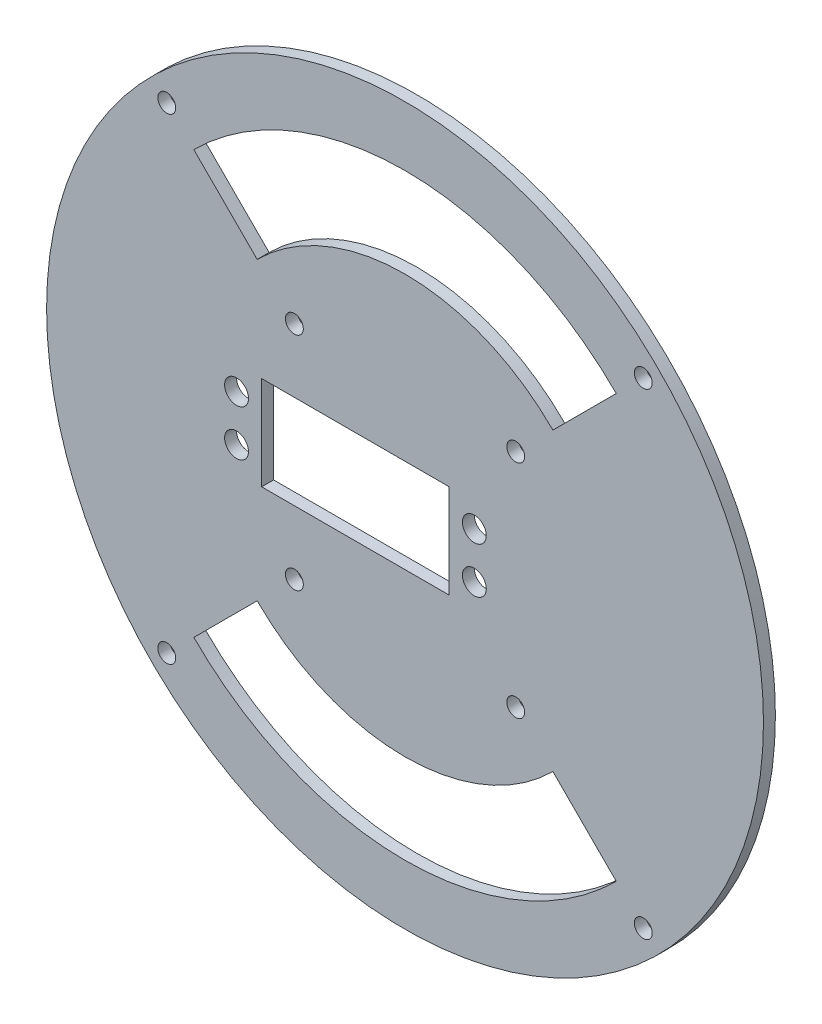
ISO-10303-21;
HEADER;
FILE_DESCRIPTION(('STEP AP214'),'2;1');
FILE_NAME('part.step','',(''),(''),'','','');
FILE_SCHEMA(('AUTOMOTIVE_DESIGN { 1 0 10303 214 1 1 1 1 }'));
ENDSEC;
DATA;
#1=APPLICATION_CONTEXT('core data for automotive mechanical design processes');
#2=APPLICATION_PROTOCOL_DEFINITION('international standard','automotive_design',2000,#1);
#3=PRODUCT_CONTEXT('',#1,'mechanical');
#4=PRODUCT('Part','Part','',(#3));
#5=PRODUCT_RELATED_PRODUCT_CATEGORY('part','',(#4));
#6=PRODUCT_DEFINITION_FORMATION('','',#4);
#7=PRODUCT_DEFINITION_CONTEXT('part definition',#1,'design');
#8=PRODUCT_DEFINITION('design','',#6,#7);
#9=PRODUCT_DEFINITION_SHAPE('','',#8);
#10=(LENGTH_UNIT() NAMED_UNIT(*) SI_UNIT(.MILLI.,.METRE.));
#11=(NAMED_UNIT(*) PLANE_ANGLE_UNIT() SI_UNIT($,.RADIAN.));
#12=(NAMED_UNIT(*) SI_UNIT($,.STERADIAN.) SOLID_ANGLE_UNIT());
#13=UNCERTAINTY_MEASURE_WITH_UNIT(LENGTH_MEASURE(1.E-05),#10,'distance_accuracy_value','');
#14=(GEOMETRIC_REPRESENTATION_CONTEXT(3) GLOBAL_UNCERTAINTY_ASSIGNED_CONTEXT((#13)) GLOBAL_UNIT_ASSIGNED_CONTEXT((#10,
#11,#12)) REPRESENTATION_CONTEXT('',''));
#15=CARTESIAN_POINT('',(0.,0.,0.));
#16=DIRECTION('',(0.,0.,1.));
#17=DIRECTION('',(1.,0.,0.));
#18=AXIS2_PLACEMENT_3D('',#15,#16,#17);
#19=CARTESIAN_POINT('',(0.,0.,2.54));
#20=DIRECTION('',(0.,0.,1.));
#21=DIRECTION('',(1.,0.,0.));
#22=AXIS2_PLACEMENT_3D('',#19,#20,#21);
#23=PLANE('',#22);
#24=CARTESIAN_POINT('',(-50.6486445228304,-50.6486445228297,2.54));
#25=DIRECTION('',(0.,0.,1.));
#26=DIRECTION('',(1.,0.,0.));
#27=AXIS2_PLACEMENT_3D('',#24,#25,#26);
#28=CIRCLE('',#27,1.905);
#29=CARTESIAN_POINT('',(-48.7436445228304,-50.6486445228297,2.54));
#30=VERTEX_POINT('',#29);
#31=EDGE_CURVE('E366',#30,#30,#28,.T.);
#32=ORIENTED_EDGE('',*,*,#31,.F.);
#33=EDGE_LOOP('',(#32));
#34=FACE_BOUND('',#33,.T.);
#35=CARTESIAN_POINT('',(-23.5282710372009,23.5282710372014,2.54));
#36=DIRECTION('',(0.,0.,1.));
#37=DIRECTION('',(1.,0.,0.));
#38=AXIS2_PLACEMENT_3D('',#35,#36,#37);
#39=CIRCLE('',#38,1.905);
#40=CARTESIAN_POINT('',(-21.6232710372009,23.5282710372014,2.54));
#41=VERTEX_POINT('',#40);
#42=EDGE_CURVE('E378',#41,#41,#39,.T.);
#43=ORIENTED_EDGE('',*,*,#42,.F.);
#44=EDGE_LOOP('',(#43));
#45=FACE_BOUND('',#44,.T.);
#46=CARTESIAN_POINT('',(23.5282710372011,-23.5282710372013,2.54));
#47=DIRECTION('',(0.,0.,1.));
#48=DIRECTION('',(1.,0.,0.));
#49=AXIS2_PLACEMENT_3D('',#46,#47,#48);
#50=CIRCLE('',#49,1.905);
#51=CARTESIAN_POINT('',(25.4332710372011,-23.5282710372013,2.54));
#52=VERTEX_POINT('',#51);
#53=EDGE_CURVE('E390',#52,#52,#50,.T.);
#54=ORIENTED_EDGE('',*,*,#53,.F.);
#55=EDGE_LOOP('',(#54));
#56=FACE_BOUND('',#55,.T.);
#57=DIRECTION('',(0.707106781186551,0.707106781186544,0.));
#58=VECTOR('',#57,1.);
#59=CARTESIAN_POINT('',(44.901280605346,44.9012806053455,2.54));
#60=LINE('',#59,#58);
#61=CARTESIAN_POINT('',(31.4308964237422,31.4308964237419,2.54));
#62=VERTEX_POINT('',#61);
#63=CARTESIAN_POINT('',(44.901280605346,44.9012806053455,2.54));
#64=VERTEX_POINT('',#63);
#65=EDGE_CURVE('E144',#62,#64,#60,.T.);
#66=ORIENTED_EDGE('',*,*,#65,.F.);
#67=CARTESIAN_POINT('',(0.,0.,2.54));
#68=DIRECTION('',(0.,0.,-1.));
#69=DIRECTION('',(1.,0.,0.));
#70=AXIS2_PLACEMENT_3D('',#67,#68,#69);
#71=CIRCLE('',#70,44.45);
#72=CARTESIAN_POINT('',(-31.4308964237318,31.4308964237523,2.54));
#73=VERTEX_POINT('',#72);
#74=EDGE_CURVE('E135',#73,#62,#71,.T.);
#75=ORIENTED_EDGE('',*,*,#74,.F.);
#76=DIRECTION('',(0.707106781186544,-0.707106781186551,0.));
#77=VECTOR('',#76,1.);
#78=CARTESIAN_POINT('',(-31.4308964237318,31.4308964237523,2.54));
#79=LINE('',#78,#77);
#80=CARTESIAN_POINT('',(-44.9012806053355,44.9012806053561,2.54));
#81=VERTEX_POINT('',#80);
#82=EDGE_CURVE('E162',#81,#73,#79,.T.);
#83=ORIENTED_EDGE('',*,*,#82,.F.);
#84=CARTESIAN_POINT('',(0.,0.,2.54));
#85=DIRECTION('',(0.,0.,1.));
#86=DIRECTION('',(-1.,0.,0.));
#87=AXIS2_PLACEMENT_3D('',#84,#85,#86);
#88=CIRCLE('',#87,63.5);
#89=EDGE_CURVE('E158',#64,#81,#88,.T.);
#90=ORIENTED_EDGE('',*,*,#89,.F.);
#91=EDGE_LOOP('',(#66,#75,#83,#90));
#92=FACE_BOUND('',#91,.T.);
#93=CARTESIAN_POINT('',(23.5282710372012,23.5282710372012,2.54));
#94=DIRECTION('',(0.,0.,1.));
#95=DIRECTION('',(1.,0.,0.));
#96=AXIS2_PLACEMENT_3D('',#93,#94,#95);
#97=CIRCLE('',#96,1.905);
#98=CARTESIAN_POINT('',(25.4332710372012,23.5282710372012,2.54));
#99=VERTEX_POINT('',#98);
#100=EDGE_CURVE('E186',#99,#99,#97,.T.);
#101=ORIENTED_EDGE('',*,*,#100,.F.);
#102=EDGE_LOOP('',(#101));
#103=FACE_BOUND('',#102,.T.);
#104=CARTESIAN_POINT('',(-35.814,4.8895,2.54));
#105=DIRECTION('',(0.,0.,1.));
#106=DIRECTION('',(1.,0.,0.));
#107=AXIS2_PLACEMENT_3D('',#104,#105,#106);
#108=CIRCLE('',#107,2.54);
#109=CARTESIAN_POINT('',(-33.274,4.8895,2.54));
#110=VERTEX_POINT('',#109);
#111=EDGE_CURVE('E245',#110,#110,#108,.T.);
#112=ORIENTED_EDGE('',*,*,#111,.F.);
#113=EDGE_LOOP('',(#112));
#114=FACE_BOUND('',#113,.T.);
#115=CARTESIAN_POINT('',(14.732,-4.8895,2.54));
#116=DIRECTION('',(0.,0.,1.));
#117=DIRECTION('',(1.,0.,0.));
#118=AXIS2_PLACEMENT_3D('',#115,#116,#117);
#119=CIRCLE('',#118,2.54);
#120=CARTESIAN_POINT('',(17.272,-4.8895,2.54));
#121=VERTEX_POINT('',#120);
#122=EDGE_CURVE('E261',#121,#121,#119,.T.);
#123=ORIENTED_EDGE('',*,*,#122,.F.);
#124=EDGE_LOOP('',(#123));
#125=FACE_BOUND('',#124,.T.);
#126=CARTESIAN_POINT('',(0.,0.,2.54));
#127=DIRECTION('',(0.,0.,1.));
#128=DIRECTION('',(1.,0.,0.));
#129=AXIS2_PLACEMENT_3D('',#126,#127,#128);
#130=CIRCLE('',#129,76.2);
#131=CARTESIAN_POINT('',(76.2,0.,2.54));
#132=VERTEX_POINT('',#131);
#133=EDGE_CURVE('E11',#132,#132,#130,.T.);
#134=ORIENTED_EDGE('',*,*,#133,.T.);
#135=EDGE_LOOP('',(#134));
#136=FACE_BOUND('',#135,.T.);
#137=DIRECTION('',(1.,0.,0.));
#138=VECTOR('',#137,1.);
#139=CARTESIAN_POINT('',(-30.48,-9.9695,2.54));
#140=LINE('',#139,#138);
#141=CARTESIAN_POINT('',(-30.48,-9.9695,2.54));
#142=VERTEX_POINT('',#141);
#143=CARTESIAN_POINT('',(9.398,-9.9695,2.54));
#144=VERTEX_POINT('',#143);
#145=EDGE_CURVE('E272',#142,#144,#140,.T.);
#146=ORIENTED_EDGE('',*,*,#145,.F.);
#147=DIRECTION('',(0.,-1.,0.));
#148=VECTOR('',#147,1.);
#149=CARTESIAN_POINT('',(-30.48,-9.9695,2.54));
#150=LINE('',#149,#148);
#151=CARTESIAN_POINT('',(-30.48,9.9695,2.54));
#152=VERTEX_POINT('',#151);
#153=EDGE_CURVE('E269',#152,#142,#150,.T.);
#154=ORIENTED_EDGE('',*,*,#153,.F.);
#155=DIRECTION('',(-1.,0.,0.));
#156=VECTOR('',#155,1.);
#157=CARTESIAN_POINT('',(-30.48,9.9695,2.54));
#158=LINE('',#157,#156);
#159=CARTESIAN_POINT('',(9.398,9.9695,2.54));
#160=VERTEX_POINT('',#159);
#161=EDGE_CURVE('E280',#160,#152,#158,.T.);
#162=ORIENTED_EDGE('',*,*,#161,.F.);
#163=DIRECTION('',(0.,1.,0.));
#164=VECTOR('',#163,1.);
#165=CARTESIAN_POINT('',(9.398,-9.9695,2.54));
#166=LINE('',#165,#164);
#167=EDGE_CURVE('E276',#144,#160,#166,.T.);
#168=ORIENTED_EDGE('',*,*,#167,.F.);
#169=EDGE_LOOP('',(#146,#154,#162,#168));
#170=FACE_BOUND('',#169,.T.);
#171=CARTESIAN_POINT('',(14.732,4.8895,2.54));
#172=DIRECTION('',(0.,0.,1.));
#173=DIRECTION('',(1.,0.,0.));
#174=AXIS2_PLACEMENT_3D('',#171,#172,#173);
#175=CIRCLE('',#174,2.54);
#176=CARTESIAN_POINT('',(17.272,4.8895,2.54));
#177=VERTEX_POINT('',#176);
#178=EDGE_CURVE('E253',#177,#177,#175,.T.);
#179=ORIENTED_EDGE('',*,*,#178,.F.);
#180=EDGE_LOOP('',(#179));
#181=FACE_BOUND('',#180,.T.);
#182=CARTESIAN_POINT('',(-35.814,-4.8895,2.54));
#183=DIRECTION('',(0.,0.,1.));
#184=DIRECTION('',(1.,0.,0.));
#185=AXIS2_PLACEMENT_3D('',#182,#183,#184);
#186=CIRCLE('',#185,2.54);
#187=CARTESIAN_POINT('',(-33.274,-4.8895,2.54));
#188=VERTEX_POINT('',#187);
#189=EDGE_CURVE('E237',#188,#188,#186,.T.);
#190=ORIENTED_EDGE('',*,*,#189,.F.);
#191=EDGE_LOOP('',(#190));
#192=FACE_BOUND('',#191,.T.);
#193=DIRECTION('',(-0.707106781186546,-0.707106781186549,0.));
#194=VECTOR('',#193,1.);
#195=CARTESIAN_POINT('',(-44.9012806053457,-44.9012806053459,2.54));
#196=LINE('',#195,#194);
#197=CARTESIAN_POINT('',(-31.430896423742,-31.4308964237421,2.54));
#198=VERTEX_POINT('',#197);
#199=CARTESIAN_POINT('',(-44.9012806053457,-44.9012806053459,2.54));
#200=VERTEX_POINT('',#199);
#201=EDGE_CURVE('E197',#198,#200,#196,.T.);
#202=ORIENTED_EDGE('',*,*,#201,.F.);
#203=CARTESIAN_POINT('',(0.,0.,2.54));
#204=DIRECTION('',(0.,0.,-1.));
#205=DIRECTION('',(1.,0.,0.));
#206=AXIS2_PLACEMENT_3D('',#203,#204,#205);
#207=CIRCLE('',#206,44.45);
#208=CARTESIAN_POINT('',(31.4308964237321,-31.430896423752,2.54));
#209=VERTEX_POINT('',#208);
#210=EDGE_CURVE('E194',#209,#198,#207,.T.);
#211=ORIENTED_EDGE('',*,*,#210,.F.);
#212=DIRECTION('',(-0.707106781186549,0.707106781186546,0.));
#213=VECTOR('',#212,1.);
#214=CARTESIAN_POINT('',(31.4308964237321,-31.430896423752,2.54));
#215=LINE('',#214,#213);
#216=CARTESIAN_POINT('',(44.9012806053358,-44.9012806053558,2.54));
#217=VERTEX_POINT('',#216);
#218=EDGE_CURVE('E205',#217,#209,#215,.T.);
#219=ORIENTED_EDGE('',*,*,#218,.F.);
#220=CARTESIAN_POINT('',(0.,0.,2.54));
#221=DIRECTION('',(0.,0.,1.));
#222=DIRECTION('',(-1.,0.,0.));
#223=AXIS2_PLACEMENT_3D('',#220,#221,#222);
#224=CIRCLE('',#223,63.5);
#225=EDGE_CURVE('E201',#200,#217,#224,.T.);
#226=ORIENTED_EDGE('',*,*,#225,.F.);
#227=EDGE_LOOP('',(#202,#211,#219,#226));
#228=FACE_BOUND('',#227,.T.);
#229=CARTESIAN_POINT('',(50.64864452283,50.64864452283,2.54));
#230=DIRECTION('',(0.,0.,1.));
#231=DIRECTION('',(1.,0.,0.));
#232=AXIS2_PLACEMENT_3D('',#229,#230,#231);
#233=CIRCLE('',#232,1.905);
#234=CARTESIAN_POINT('',(52.55364452283,50.64864452283,2.54));
#235=VERTEX_POINT('',#234);
#236=EDGE_CURVE('E170',#235,#235,#233,.T.);
#237=ORIENTED_EDGE('',*,*,#236,.F.);
#238=EDGE_LOOP('',(#237));
#239=FACE_BOUND('',#238,.T.);
#240=CARTESIAN_POINT('',(-23.5282710372013,-23.528271037201,2.54));
#241=DIRECTION('',(0.,0.,1.));
#242=DIRECTION('',(1.,0.,0.));
#243=AXIS2_PLACEMENT_3D('',#240,#241,#242);
#244=CIRCLE('',#243,1.905);
#245=CARTESIAN_POINT('',(-21.6232710372013,-23.528271037201,2.54));
#246=VERTEX_POINT('',#245);
#247=EDGE_CURVE('E384',#246,#246,#244,.T.);
#248=ORIENTED_EDGE('',*,*,#247,.F.);
#249=EDGE_LOOP('',(#248));
#250=FACE_BOUND('',#249,.T.);
#251=CARTESIAN_POINT('',(50.6486445228298,-50.6486445228302,2.54));
#252=DIRECTION('',(0.,0.,1.));
#253=DIRECTION('',(1.,0.,0.));
#254=AXIS2_PLACEMENT_3D('',#251,#252,#253);
#255=CIRCLE('',#254,1.905);
#256=CARTESIAN_POINT('',(52.5536445228298,-50.6486445228302,2.54));
#257=VERTEX_POINT('',#256);
#258=EDGE_CURVE('E372',#257,#257,#255,.T.);
#259=ORIENTED_EDGE('',*,*,#258,.F.);
#260=EDGE_LOOP('',(#259));
#261=FACE_BOUND('',#260,.T.);
#262=CARTESIAN_POINT('',(-50.6486445228295,50.6486445228306,2.54));
#263=DIRECTION('',(0.,0.,1.));
#264=DIRECTION('',(1.,0.,0.));
#265=AXIS2_PLACEMENT_3D('',#262,#263,#264);
#266=CIRCLE('',#265,1.905);
#267=CARTESIAN_POINT('',(-48.7436445228295,50.6486445228306,2.54));
#268=VERTEX_POINT('',#267);
#269=EDGE_CURVE('E360',#268,#268,#266,.T.);
#270=ORIENTED_EDGE('',*,*,#269,.F.);
#271=EDGE_LOOP('',(#270));
#272=FACE_BOUND('',#271,.T.);
#273=ADVANCED_FACE('F45',(#34,#45,#56,#92,#103,#114,#125,#136,#170,#181,#192,#228,#239,#250,
#261,#272),#23,.T.);
#274=CARTESIAN_POINT('',(0.,0.,0.));
#275=DIRECTION('',(0.,0.,1.));
#276=DIRECTION('',(1.,0.,0.));
#277=AXIS2_PLACEMENT_3D('',#274,#275,#276);
#278=PLANE('',#277);
#279=CARTESIAN_POINT('',(23.5282710372012,23.5282710372012,0.));
#280=DIRECTION('',(0.,0.,1.));
#281=DIRECTION('',(1.,0.,0.));
#282=AXIS2_PLACEMENT_3D('',#279,#280,#281);
#283=CIRCLE('',#282,1.905);
#284=CARTESIAN_POINT('',(25.4332710372012,23.5282710372012,0.));
#285=VERTEX_POINT('',#284);
#286=EDGE_CURVE('E153',#285,#285,#283,.T.);
#287=ORIENTED_EDGE('',*,*,#286,.T.);
#288=EDGE_LOOP('',(#287));
#289=FACE_BOUND('',#288,.T.);
#290=CARTESIAN_POINT('',(0.,0.,0.));
#291=DIRECTION('',(0.,0.,-1.));
#292=DIRECTION('',(1.,0.,0.));
#293=AXIS2_PLACEMENT_3D('',#290,#291,#292);
#294=CIRCLE('',#293,44.45);
#295=CARTESIAN_POINT('',(31.4308964237321,-31.430896423752,0.));
#296=VERTEX_POINT('',#295);
#297=CARTESIAN_POINT('',(-31.430896423742,-31.4308964237421,0.));
#298=VERTEX_POINT('',#297);
#299=EDGE_CURVE('E190',#296,#298,#294,.T.);
#300=ORIENTED_EDGE('',*,*,#299,.T.);
#301=DIRECTION('',(-0.707106781186546,-0.707106781186549,0.));
#302=VECTOR('',#301,1.);
#303=CARTESIAN_POINT('',(-44.9012806053457,-44.9012806053459,0.));
#304=LINE('',#303,#302);
#305=CARTESIAN_POINT('',(-44.9012806053457,-44.9012806053459,0.));
#306=VERTEX_POINT('',#305);
#307=EDGE_CURVE('E212',#298,#306,#304,.T.);
#308=ORIENTED_EDGE('',*,*,#307,.T.);
#309=CARTESIAN_POINT('',(0.,0.,0.));
#310=DIRECTION('',(0.,0.,1.));
#311=DIRECTION('',(-1.,0.,0.));
#312=AXIS2_PLACEMENT_3D('',#309,#310,#311);
#313=CIRCLE('',#312,63.5);
#314=CARTESIAN_POINT('',(44.9012806053358,-44.9012806053558,0.));
#315=VERTEX_POINT('',#314);
#316=EDGE_CURVE('E216',#306,#315,#313,.T.);
#317=ORIENTED_EDGE('',*,*,#316,.T.);
#318=DIRECTION('',(-0.707106781186549,0.707106781186546,0.));
#319=VECTOR('',#318,1.);
#320=CARTESIAN_POINT('',(31.4308964237321,-31.430896423752,0.));
#321=LINE('',#320,#319);
#322=EDGE_CURVE('E198',#315,#296,#321,.T.);
#323=ORIENTED_EDGE('',*,*,#322,.T.);
#324=EDGE_LOOP('',(#300,#308,#317,#323));
#325=FACE_BOUND('',#324,.T.);
#326=CARTESIAN_POINT('',(0.,0.,0.));
#327=DIRECTION('',(0.,0.,1.));
#328=DIRECTION('',(1.,0.,0.));
#329=AXIS2_PLACEMENT_3D('',#326,#327,#328);
#330=CIRCLE('',#329,76.2);
#331=CARTESIAN_POINT('',(76.2,0.,0.));
#332=VERTEX_POINT('',#331);
#333=EDGE_CURVE('E49',#332,#332,#330,.T.);
#334=ORIENTED_EDGE('',*,*,#333,.F.);
#335=EDGE_LOOP('',(#334));
#336=FACE_BOUND('',#335,.T.);
#337=DIRECTION('',(0.,-1.,0.));
#338=VECTOR('',#337,1.);
#339=CARTESIAN_POINT('',(-30.48,-9.9695,0.));
#340=LINE('',#339,#338);
#341=CARTESIAN_POINT('',(-30.48,9.9695,0.));
#342=VERTEX_POINT('',#341);
#343=CARTESIAN_POINT('',(-30.48,-9.9695,0.));
#344=VERTEX_POINT('',#343);
#345=EDGE_CURVE('E265',#342,#344,#340,.T.);
#346=ORIENTED_EDGE('',*,*,#345,.T.);
#347=DIRECTION('',(1.,0.,0.));
#348=VECTOR('',#347,1.);
#349=CARTESIAN_POINT('',(-30.48,-9.9695,0.));
#350=LINE('',#349,#348);
#351=CARTESIAN_POINT('',(9.398,-9.9695,0.));
#352=VERTEX_POINT('',#351);
#353=EDGE_CURVE('E287',#344,#352,#350,.T.);
#354=ORIENTED_EDGE('',*,*,#353,.T.);
#355=DIRECTION('',(0.,1.,0.));
#356=VECTOR('',#355,1.);
#357=CARTESIAN_POINT('',(9.398,-9.9695,0.));
#358=LINE('',#357,#356);
#359=CARTESIAN_POINT('',(9.398,9.9695,0.));
#360=VERTEX_POINT('',#359);
#361=EDGE_CURVE('E291',#352,#360,#358,.T.);
#362=ORIENTED_EDGE('',*,*,#361,.T.);
#363=DIRECTION('',(-1.,0.,0.));
#364=VECTOR('',#363,1.);
#365=CARTESIAN_POINT('',(-30.48,9.9695,0.));
#366=LINE('',#365,#364);
#367=EDGE_CURVE('E273',#360,#342,#366,.T.);
#368=ORIENTED_EDGE('',*,*,#367,.T.);
#369=EDGE_LOOP('',(#346,#354,#362,#368));
#370=FACE_BOUND('',#369,.T.);
#371=CARTESIAN_POINT('',(14.732,-4.8895,0.));
#372=DIRECTION('',(0.,0.,1.));
#373=DIRECTION('',(1.,0.,0.));
#374=AXIS2_PLACEMENT_3D('',#371,#372,#373);
#375=CIRCLE('',#374,2.54);
#376=CARTESIAN_POINT('',(17.272,-4.8895,0.));
#377=VERTEX_POINT('',#376);
#378=EDGE_CURVE('E257',#377,#377,#375,.T.);
#379=ORIENTED_EDGE('',*,*,#378,.T.);
#380=EDGE_LOOP('',(#379));
#381=FACE_BOUND('',#380,.T.);
#382=CARTESIAN_POINT('',(14.732,4.8895,0.));
#383=DIRECTION('',(0.,0.,1.));
#384=DIRECTION('',(1.,0.,0.));
#385=AXIS2_PLACEMENT_3D('',#382,#383,#384);
#386=CIRCLE('',#385,2.54);
#387=CARTESIAN_POINT('',(17.272,4.8895,0.));
#388=VERTEX_POINT('',#387);
#389=EDGE_CURVE('E249',#388,#388,#386,.T.);
#390=ORIENTED_EDGE('',*,*,#389,.T.);
#391=EDGE_LOOP('',(#390));
#392=FACE_BOUND('',#391,.T.);
#393=CARTESIAN_POINT('',(-35.814,4.8895,0.));
#394=DIRECTION('',(0.,0.,1.));
#395=DIRECTION('',(1.,0.,0.));
#396=AXIS2_PLACEMENT_3D('',#393,#394,#395);
#397=CIRCLE('',#396,2.54);
#398=CARTESIAN_POINT('',(-33.274,4.8895,0.));
#399=VERTEX_POINT('',#398);
#400=EDGE_CURVE('E241',#399,#399,#397,.T.);
#401=ORIENTED_EDGE('',*,*,#400,.T.);
#402=EDGE_LOOP('',(#401));
#403=FACE_BOUND('',#402,.T.);
#404=CARTESIAN_POINT('',(-35.814,-4.8895,0.));
#405=DIRECTION('',(0.,0.,1.));
#406=DIRECTION('',(1.,0.,0.));
#407=AXIS2_PLACEMENT_3D('',#404,#405,#406);
#408=CIRCLE('',#407,2.54);
#409=CARTESIAN_POINT('',(-33.274,-4.8895,0.));
#410=VERTEX_POINT('',#409);
#411=EDGE_CURVE('E236',#410,#410,#408,.T.);
#412=ORIENTED_EDGE('',*,*,#411,.T.);
#413=EDGE_LOOP('',(#412));
#414=FACE_BOUND('',#413,.T.);
#415=CARTESIAN_POINT('',(0.,0.,0.));
#416=DIRECTION('',(0.,0.,-1.));
#417=DIRECTION('',(1.,0.,0.));
#418=AXIS2_PLACEMENT_3D('',#415,#416,#417);
#419=CIRCLE('',#418,44.45);
#420=CARTESIAN_POINT('',(-31.4308964237318,31.4308964237523,0.));
#421=VERTEX_POINT('',#420);
#422=CARTESIAN_POINT('',(31.4308964237422,31.4308964237419,0.));
#423=VERTEX_POINT('',#422);
#424=EDGE_CURVE('E69',#421,#423,#419,.T.);
#425=ORIENTED_EDGE('',*,*,#424,.T.);
#426=DIRECTION('',(0.707106781186551,0.707106781186544,0.));
#427=VECTOR('',#426,1.);
#428=CARTESIAN_POINT('',(44.901280605346,44.9012806053455,0.));
#429=LINE('',#428,#427);
#430=CARTESIAN_POINT('',(44.901280605346,44.9012806053455,0.));
#431=VERTEX_POINT('',#430);
#432=EDGE_CURVE('E151',#423,#431,#429,.T.);
#433=ORIENTED_EDGE('',*,*,#432,.T.);
#434=CARTESIAN_POINT('',(0.,0.,0.));
#435=DIRECTION('',(0.,0.,1.));
#436=DIRECTION('',(-1.,0.,0.));
#437=AXIS2_PLACEMENT_3D('',#434,#435,#436);
#438=CIRCLE('',#437,63.5);
#439=CARTESIAN_POINT('',(-44.9012806053355,44.9012806053561,0.));
#440=VERTEX_POINT('',#439);
#441=EDGE_CURVE('E173',#431,#440,#438,.T.);
#442=ORIENTED_EDGE('',*,*,#441,.T.);
#443=DIRECTION('',(0.707106781186544,-0.707106781186551,0.));
#444=VECTOR('',#443,1.);
#445=CARTESIAN_POINT('',(-31.4308964237318,31.4308964237523,0.));
#446=LINE('',#445,#444);
#447=EDGE_CURVE('E145',#440,#421,#446,.T.);
#448=ORIENTED_EDGE('',*,*,#447,.T.);
#449=EDGE_LOOP('',(#425,#433,#442,#448));
#450=FACE_BOUND('',#449,.T.);
#451=CARTESIAN_POINT('',(50.64864452283,50.64864452283,0.));
#452=DIRECTION('',(0.,0.,1.));
#453=DIRECTION('',(1.,0.,0.));
#454=AXIS2_PLACEMENT_3D('',#451,#452,#453);
#455=CIRCLE('',#454,1.905);
#456=CARTESIAN_POINT('',(52.55364452283,50.64864452283,0.));
#457=VERTEX_POINT('',#456);
#458=EDGE_CURVE('E334',#457,#457,#455,.T.);
#459=ORIENTED_EDGE('',*,*,#458,.T.);
#460=EDGE_LOOP('',(#459));
#461=FACE_BOUND('',#460,.T.);
#462=CARTESIAN_POINT('',(23.5282710372011,-23.5282710372013,0.));
#463=DIRECTION('',(0.,0.,1.));
#464=DIRECTION('',(1.,0.,0.));
#465=AXIS2_PLACEMENT_3D('',#462,#463,#464);
#466=CIRCLE('',#465,1.905);
#467=CARTESIAN_POINT('',(25.4332710372011,-23.5282710372013,0.));
#468=VERTEX_POINT('',#467);
#469=EDGE_CURVE('E338',#468,#468,#466,.T.);
#470=ORIENTED_EDGE('',*,*,#469,.T.);
#471=EDGE_LOOP('',(#470));
#472=FACE_BOUND('',#471,.T.);
#473=CARTESIAN_POINT('',(-23.5282710372013,-23.528271037201,0.));
#474=DIRECTION('',(0.,0.,1.));
#475=DIRECTION('',(1.,0.,0.));
#476=AXIS2_PLACEMENT_3D('',#473,#474,#475);
#477=CIRCLE('',#476,1.905);
#478=CARTESIAN_POINT('',(-21.6232710372013,-23.528271037201,0.));
#479=VERTEX_POINT('',#478);
#480=EDGE_CURVE('E342',#479,#479,#477,.T.);
#481=ORIENTED_EDGE('',*,*,#480,.T.);
#482=EDGE_LOOP('',(#481));
#483=FACE_BOUND('',#482,.T.);
#484=CARTESIAN_POINT('',(-23.5282710372009,23.5282710372014,0.));
#485=DIRECTION('',(0.,0.,1.));
#486=DIRECTION('',(1.,0.,0.));
#487=AXIS2_PLACEMENT_3D('',#484,#485,#486);
#488=CIRCLE('',#487,1.905);
#489=CARTESIAN_POINT('',(-21.6232710372009,23.5282710372014,0.));
#490=VERTEX_POINT('',#489);
#491=EDGE_CURVE('E346',#490,#490,#488,.T.);
#492=ORIENTED_EDGE('',*,*,#491,.T.);
#493=EDGE_LOOP('',(#492));
#494=FACE_BOUND('',#493,.T.);
#495=CARTESIAN_POINT('',(50.6486445228298,-50.6486445228302,0.));
#496=DIRECTION('',(0.,0.,1.));
#497=DIRECTION('',(1.,0.,0.));
#498=AXIS2_PLACEMENT_3D('',#495,#496,#497);
#499=CIRCLE('',#498,1.905);
#500=CARTESIAN_POINT('',(52.5536445228298,-50.6486445228302,0.));
#501=VERTEX_POINT('',#500);
#502=EDGE_CURVE('E350',#501,#501,#499,.T.);
#503=ORIENTED_EDGE('',*,*,#502,.T.);
#504=EDGE_LOOP('',(#503));
#505=FACE_BOUND('',#504,.T.);
#506=CARTESIAN_POINT('',(-50.6486445228304,-50.6486445228297,0.));
#507=DIRECTION('',(0.,0.,1.));
#508=DIRECTION('',(1.,0.,0.));
#509=AXIS2_PLACEMENT_3D('',#506,#507,#508);
#510=CIRCLE('',#509,1.905);
#511=CARTESIAN_POINT('',(-48.7436445228304,-50.6486445228297,0.));
#512=VERTEX_POINT('',#511);
#513=EDGE_CURVE('E354',#512,#512,#510,.T.);
#514=ORIENTED_EDGE('',*,*,#513,.T.);
#515=EDGE_LOOP('',(#514));
#516=FACE_BOUND('',#515,.T.);
#517=CARTESIAN_POINT('',(-50.6486445228295,50.6486445228306,0.));
#518=DIRECTION('',(0.,0.,1.));
#519=DIRECTION('',(1.,0.,0.));
#520=AXIS2_PLACEMENT_3D('',#517,#518,#519);
#521=CIRCLE('',#520,1.905);
#522=CARTESIAN_POINT('',(-48.7436445228295,50.6486445228306,0.));
#523=VERTEX_POINT('',#522);
#524=EDGE_CURVE('E357',#523,#523,#521,.T.);
#525=ORIENTED_EDGE('',*,*,#524,.T.);
#526=EDGE_LOOP('',(#525));
#527=FACE_BOUND('',#526,.T.);
#528=ADVANCED_FACE('F317',(#289,#325,#336,#370,#381,#392,#403,#414,#450,#461,#472,#483,#494,
#505,#516,#527),#278,.F.);
#529=CARTESIAN_POINT('',(0.,0.,2.54));
#530=DIRECTION('',(0.,0.,-1.));
#531=DIRECTION('',(-1.,0.,0.));
#532=AXIS2_PLACEMENT_3D('',#529,#530,#531);
#533=CYLINDRICAL_SURFACE('',#532,76.2);
#534=ORIENTED_EDGE('',*,*,#133,.F.);
#535=EDGE_LOOP('',(#534));
#536=FACE_BOUND('',#535,.T.);
#537=ORIENTED_EDGE('',*,*,#333,.T.);
#538=EDGE_LOOP('',(#537));
#539=FACE_BOUND('',#538,.T.);
#540=ADVANCED_FACE('F47',(#536,#539),#533,.T.);
#541=CARTESIAN_POINT('',(-30.48,-9.9695,2.54));
#542=DIRECTION('',(1.,0.,0.));
#543=DIRECTION('',(0.,0.,-1.));
#544=AXIS2_PLACEMENT_3D('',#541,#542,#543);
#545=PLANE('',#544);
#546=ORIENTED_EDGE('',*,*,#345,.F.);
#547=DIRECTION('',(0.,0.,-1.));
#548=VECTOR('',#547,1.);
#549=CARTESIAN_POINT('',(-30.48,9.9695,2.54));
#550=LINE('',#549,#548);
#551=EDGE_CURVE('E283',#152,#342,#550,.T.);
#552=ORIENTED_EDGE('',*,*,#551,.F.);
#553=ORIENTED_EDGE('',*,*,#153,.T.);
#554=DIRECTION('',(0.,0.,-1.));
#555=VECTOR('',#554,1.);
#556=CARTESIAN_POINT('',(-30.48,-9.9695,2.54));
#557=LINE('',#556,#555);
#558=EDGE_CURVE('E307',#142,#344,#557,.T.);
#559=ORIENTED_EDGE('',*,*,#558,.T.);
#560=EDGE_LOOP('',(#546,#552,#553,#559));
#561=FACE_BOUND('',#560,.T.);
#562=ADVANCED_FACE('F500',(#561),#545,.T.);
#563=CARTESIAN_POINT('',(-30.48,-9.9695,2.54));
#564=DIRECTION('',(0.,1.,0.));
#565=DIRECTION('',(0.,0.,1.));
#566=AXIS2_PLACEMENT_3D('',#563,#564,#565);
#567=PLANE('',#566);
#568=ORIENTED_EDGE('',*,*,#353,.F.);
#569=ORIENTED_EDGE('',*,*,#558,.F.);
#570=ORIENTED_EDGE('',*,*,#145,.T.);
#571=DIRECTION('',(0.,0.,-1.));
#572=VECTOR('',#571,1.);
#573=CARTESIAN_POINT('',(9.398,-9.9695,2.54));
#574=LINE('',#573,#572);
#575=EDGE_CURVE('E304',#144,#352,#574,.T.);
#576=ORIENTED_EDGE('',*,*,#575,.T.);
#577=EDGE_LOOP('',(#568,#569,#570,#576));
#578=FACE_BOUND('',#577,.T.);
#579=ADVANCED_FACE('F496',(#578),#567,.T.);
#580=CARTESIAN_POINT('',(9.398,-9.9695,2.54));
#581=DIRECTION('',(-1.,0.,0.));
#582=DIRECTION('',(0.,0.,1.));
#583=AXIS2_PLACEMENT_3D('',#580,#581,#582);
#584=PLANE('',#583);
#585=ORIENTED_EDGE('',*,*,#361,.F.);
#586=ORIENTED_EDGE('',*,*,#575,.F.);
#587=ORIENTED_EDGE('',*,*,#167,.T.);
#588=DIRECTION('',(0.,0.,-1.));
#589=VECTOR('',#588,1.);
#590=CARTESIAN_POINT('',(9.398,9.9695,2.54));
#591=LINE('',#590,#589);
#592=EDGE_CURVE('E301',#160,#360,#591,.T.);
#593=ORIENTED_EDGE('',*,*,#592,.T.);
#594=EDGE_LOOP('',(#585,#586,#587,#593));
#595=FACE_BOUND('',#594,.T.);
#596=ADVANCED_FACE('F492',(#595),#584,.T.);
#597=CARTESIAN_POINT('',(-30.48,9.9695,2.54));
#598=DIRECTION('',(0.,-1.,0.));
#599=DIRECTION('',(0.,0.,-1.));
#600=AXIS2_PLACEMENT_3D('',#597,#598,#599);
#601=PLANE('',#600);
#602=ORIENTED_EDGE('',*,*,#367,.F.);
#603=ORIENTED_EDGE('',*,*,#592,.F.);
#604=ORIENTED_EDGE('',*,*,#161,.T.);
#605=ORIENTED_EDGE('',*,*,#551,.T.);
#606=EDGE_LOOP('',(#602,#603,#604,#605));
#607=FACE_BOUND('',#606,.T.);
#608=ADVANCED_FACE('F488',(#607),#601,.T.);
#609=CARTESIAN_POINT('',(14.732,-4.8895,2.54));
#610=DIRECTION('',(0.,0.,-1.));
#611=DIRECTION('',(-1.,0.,0.));
#612=AXIS2_PLACEMENT_3D('',#609,#610,#611);
#613=CYLINDRICAL_SURFACE('',#612,2.54);
#614=ORIENTED_EDGE('',*,*,#122,.T.);
#615=EDGE_LOOP('',(#614));
#616=FACE_BOUND('',#615,.T.);
#617=ORIENTED_EDGE('',*,*,#378,.F.);
#618=EDGE_LOOP('',(#617));
#619=FACE_BOUND('',#618,.T.);
#620=ADVANCED_FACE('F484',(#616,#619),#613,.F.);
#621=CARTESIAN_POINT('',(14.732,4.8895,2.54));
#622=DIRECTION('',(0.,0.,-1.));
#623=DIRECTION('',(-1.,0.,0.));
#624=AXIS2_PLACEMENT_3D('',#621,#622,#623);
#625=CYLINDRICAL_SURFACE('',#624,2.54);
#626=ORIENTED_EDGE('',*,*,#178,.T.);
#627=EDGE_LOOP('',(#626));
#628=FACE_BOUND('',#627,.T.);
#629=ORIENTED_EDGE('',*,*,#389,.F.);
#630=EDGE_LOOP('',(#629));
#631=FACE_BOUND('',#630,.T.);
#632=ADVANCED_FACE('F480',(#628,#631),#625,.F.);
#633=CARTESIAN_POINT('',(-35.814,4.8895,2.54));
#634=DIRECTION('',(0.,0.,-1.));
#635=DIRECTION('',(-1.,0.,0.));
#636=AXIS2_PLACEMENT_3D('',#633,#634,#635);
#637=CYLINDRICAL_SURFACE('',#636,2.54);
#638=ORIENTED_EDGE('',*,*,#111,.T.);
#639=EDGE_LOOP('',(#638));
#640=FACE_BOUND('',#639,.T.);
#641=ORIENTED_EDGE('',*,*,#400,.F.);
#642=EDGE_LOOP('',(#641));
#643=FACE_BOUND('',#642,.T.);
#644=ADVANCED_FACE('F476',(#640,#643),#637,.F.);
#645=CARTESIAN_POINT('',(-35.814,-4.8895,2.54));
#646=DIRECTION('',(0.,0.,-1.));
#647=DIRECTION('',(-1.,0.,0.));
#648=AXIS2_PLACEMENT_3D('',#645,#646,#647);
#649=CYLINDRICAL_SURFACE('',#648,2.54);
#650=ORIENTED_EDGE('',*,*,#189,.T.);
#651=EDGE_LOOP('',(#650));
#652=FACE_BOUND('',#651,.T.);
#653=ORIENTED_EDGE('',*,*,#411,.F.);
#654=EDGE_LOOP('',(#653));
#655=FACE_BOUND('',#654,.T.);
#656=ADVANCED_FACE('F472',(#652,#655),#649,.F.);
#657=CARTESIAN_POINT('',(0.,0.,2.54));
#658=DIRECTION('',(0.,0.,-1.));
#659=DIRECTION('',(-1.,0.,0.));
#660=AXIS2_PLACEMENT_3D('',#657,#658,#659);
#661=CYLINDRICAL_SURFACE('',#660,44.45);
#662=ORIENTED_EDGE('',*,*,#299,.F.);
#663=DIRECTION('',(0.,0.,-1.));
#664=VECTOR('',#663,1.);
#665=CARTESIAN_POINT('',(31.4308964237321,-31.430896423752,2.54));
#666=LINE('',#665,#664);
#667=EDGE_CURVE('E208',#209,#296,#666,.T.);
#668=ORIENTED_EDGE('',*,*,#667,.F.);
#669=ORIENTED_EDGE('',*,*,#210,.T.);
#670=DIRECTION('',(0.,0.,-1.));
#671=VECTOR('',#670,1.);
#672=CARTESIAN_POINT('',(-31.430896423742,-31.4308964237421,2.54));
#673=LINE('',#672,#671);
#674=EDGE_CURVE('E232',#198,#298,#673,.T.);
#675=ORIENTED_EDGE('',*,*,#674,.T.);
#676=EDGE_LOOP('',(#662,#668,#669,#675));
#677=FACE_BOUND('',#676,.T.);
#678=ADVANCED_FACE('F468',(#677),#661,.T.);
#679=CARTESIAN_POINT('',(-44.9012806053457,-44.9012806053459,2.54));
#680=DIRECTION('',(0.707106781186549,-0.707106781186546,0.));
#681=DIRECTION('',(0.707106781186546,0.707106781186549,0.));
#682=AXIS2_PLACEMENT_3D('',#679,#680,#681);
#683=PLANE('',#682);
#684=ORIENTED_EDGE('',*,*,#307,.F.);
#685=ORIENTED_EDGE('',*,*,#674,.F.);
#686=ORIENTED_EDGE('',*,*,#201,.T.);
#687=DIRECTION('',(0.,0.,-1.));
#688=VECTOR('',#687,1.);
#689=CARTESIAN_POINT('',(-44.9012806053457,-44.9012806053459,2.54));
#690=LINE('',#689,#688);
#691=EDGE_CURVE('E229',#200,#306,#690,.T.);
#692=ORIENTED_EDGE('',*,*,#691,.T.);
#693=EDGE_LOOP('',(#684,#685,#686,#692));
#694=FACE_BOUND('',#693,.T.);
#695=ADVANCED_FACE('F464',(#694),#683,.T.);
#696=CARTESIAN_POINT('',(0.,0.,2.54));
#697=DIRECTION('',(0.,0.,-1.));
#698=DIRECTION('',(-1.,0.,0.));
#699=AXIS2_PLACEMENT_3D('',#696,#697,#698);
#700=CYLINDRICAL_SURFACE('',#699,63.5);
#701=ORIENTED_EDGE('',*,*,#316,.F.);
#702=ORIENTED_EDGE('',*,*,#691,.F.);
#703=ORIENTED_EDGE('',*,*,#225,.T.);
#704=DIRECTION('',(0.,0.,-1.));
#705=VECTOR('',#704,1.);
#706=CARTESIAN_POINT('',(44.9012806053358,-44.9012806053558,2.54));
#707=LINE('',#706,#705);
#708=EDGE_CURVE('E226',#217,#315,#707,.T.);
#709=ORIENTED_EDGE('',*,*,#708,.T.);
#710=EDGE_LOOP('',(#701,#702,#703,#709));
#711=FACE_BOUND('',#710,.T.);
#712=ADVANCED_FACE('F460',(#711),#700,.F.);
#713=CARTESIAN_POINT('',(31.4308964237321,-31.430896423752,2.54));
#714=DIRECTION('',(-0.707106781186546,-0.707106781186549,0.));
#715=DIRECTION('',(0.707106781186549,-0.707106781186546,0.));
#716=AXIS2_PLACEMENT_3D('',#713,#714,#715);
#717=PLANE('',#716);
#718=ORIENTED_EDGE('',*,*,#322,.F.);
#719=ORIENTED_EDGE('',*,*,#708,.F.);
#720=ORIENTED_EDGE('',*,*,#218,.T.);
#721=ORIENTED_EDGE('',*,*,#667,.T.);
#722=EDGE_LOOP('',(#718,#719,#720,#721));
#723=FACE_BOUND('',#722,.T.);
#724=ADVANCED_FACE('F456',(#723),#717,.T.);
#725=CARTESIAN_POINT('',(23.5282710372012,23.5282710372012,2.54));
#726=DIRECTION('',(0.,0.,-1.));
#727=DIRECTION('',(-1.,0.,0.));
#728=AXIS2_PLACEMENT_3D('',#725,#726,#727);
#729=CYLINDRICAL_SURFACE('',#728,1.905);
#730=ORIENTED_EDGE('',*,*,#100,.T.);
#731=EDGE_LOOP('',(#730));
#732=FACE_BOUND('',#731,.T.);
#733=ORIENTED_EDGE('',*,*,#286,.F.);
#734=EDGE_LOOP('',(#733));
#735=FACE_BOUND('',#734,.T.);
#736=ADVANCED_FACE('F453',(#732,#735),#729,.F.);
#737=CARTESIAN_POINT('',(0.,0.,2.54));
#738=DIRECTION('',(0.,0.,-1.));
#739=DIRECTION('',(-1.,0.,0.));
#740=AXIS2_PLACEMENT_3D('',#737,#738,#739);
#741=CYLINDRICAL_SURFACE('',#740,44.45);
#742=ORIENTED_EDGE('',*,*,#424,.F.);
#743=DIRECTION('',(0.,0.,-1.));
#744=VECTOR('',#743,1.);
#745=CARTESIAN_POINT('',(-31.4308964237318,31.4308964237523,2.54));
#746=LINE('',#745,#744);
#747=EDGE_CURVE('E139',#73,#421,#746,.T.);
#748=ORIENTED_EDGE('',*,*,#747,.F.);
#749=ORIENTED_EDGE('',*,*,#74,.T.);
#750=DIRECTION('',(0.,0.,-1.));
#751=VECTOR('',#750,1.);
#752=CARTESIAN_POINT('',(31.4308964237422,31.4308964237419,2.54));
#753=LINE('',#752,#751);
#754=EDGE_CURVE('E138',#62,#423,#753,.T.);
#755=ORIENTED_EDGE('',*,*,#754,.T.);
#756=EDGE_LOOP('',(#742,#748,#749,#755));
#757=FACE_BOUND('',#756,.T.);
#758=ADVANCED_FACE('F137',(#757),#741,.T.);
#759=CARTESIAN_POINT('',(44.901280605346,44.9012806053455,2.54));
#760=DIRECTION('',(-0.707106781186544,0.707106781186551,0.));
#761=DIRECTION('',(-0.707106781186551,-0.707106781186544,0.));
#762=AXIS2_PLACEMENT_3D('',#759,#760,#761);
#763=PLANE('',#762);
#764=ORIENTED_EDGE('',*,*,#432,.F.);
#765=ORIENTED_EDGE('',*,*,#754,.F.);
#766=ORIENTED_EDGE('',*,*,#65,.T.);
#767=DIRECTION('',(0.,0.,-1.));
#768=VECTOR('',#767,1.);
#769=CARTESIAN_POINT('',(44.901280605346,44.9012806053455,2.54));
#770=LINE('',#769,#768);
#771=EDGE_CURVE('E154',#64,#431,#770,.T.);
#772=ORIENTED_EDGE('',*,*,#771,.T.);
#773=EDGE_LOOP('',(#764,#765,#766,#772));
#774=FACE_BOUND('',#773,.T.);
#775=ADVANCED_FACE('F148',(#774),#763,.T.);
#776=CARTESIAN_POINT('',(0.,0.,2.54));
#777=DIRECTION('',(0.,0.,-1.));
#778=DIRECTION('',(-1.,0.,0.));
#779=AXIS2_PLACEMENT_3D('',#776,#777,#778);
#780=CYLINDRICAL_SURFACE('',#779,63.5);
#781=ORIENTED_EDGE('',*,*,#441,.F.);
#782=ORIENTED_EDGE('',*,*,#771,.F.);
#783=ORIENTED_EDGE('',*,*,#89,.T.);
#784=DIRECTION('',(0.,0.,-1.));
#785=VECTOR('',#784,1.);
#786=CARTESIAN_POINT('',(-44.9012806053355,44.9012806053561,2.54));
#787=LINE('',#786,#785);
#788=EDGE_CURVE('E61',#81,#440,#787,.T.);
#789=ORIENTED_EDGE('',*,*,#788,.T.);
#790=EDGE_LOOP('',(#781,#782,#783,#789));
#791=FACE_BOUND('',#790,.T.);
#792=ADVANCED_FACE('F445',(#791),#780,.F.);
#793=CARTESIAN_POINT('',(-31.4308964237318,31.4308964237523,2.54));
#794=DIRECTION('',(0.707106781186551,0.707106781186544,0.));
#795=DIRECTION('',(-0.707106781186544,0.707106781186551,0.));
#796=AXIS2_PLACEMENT_3D('',#793,#794,#795);
#797=PLANE('',#796);
#798=ORIENTED_EDGE('',*,*,#447,.F.);
#799=ORIENTED_EDGE('',*,*,#788,.F.);
#800=ORIENTED_EDGE('',*,*,#82,.T.);
#801=ORIENTED_EDGE('',*,*,#747,.T.);
#802=EDGE_LOOP('',(#798,#799,#800,#801));
#803=FACE_BOUND('',#802,.T.);
#804=ADVANCED_FACE('F442',(#803),#797,.T.);
#805=CARTESIAN_POINT('',(50.64864452283,50.64864452283,2.54));
#806=DIRECTION('',(0.,0.,-1.));
#807=DIRECTION('',(-1.,0.,0.));
#808=AXIS2_PLACEMENT_3D('',#805,#806,#807);
#809=CYLINDRICAL_SURFACE('',#808,1.905);
#810=ORIENTED_EDGE('',*,*,#236,.T.);
#811=EDGE_LOOP('',(#810));
#812=FACE_BOUND('',#811,.T.);
#813=ORIENTED_EDGE('',*,*,#458,.F.);
#814=EDGE_LOOP('',(#813));
#815=FACE_BOUND('',#814,.T.);
#816=ADVANCED_FACE('F401',(#812,#815),#809,.F.);
#817=CARTESIAN_POINT('',(23.5282710372011,-23.5282710372013,2.54));
#818=DIRECTION('',(0.,0.,-1.));
#819=DIRECTION('',(-1.,0.,0.));
#820=AXIS2_PLACEMENT_3D('',#817,#818,#819);
#821=CYLINDRICAL_SURFACE('',#820,1.905);
#822=ORIENTED_EDGE('',*,*,#53,.T.);
#823=EDGE_LOOP('',(#822));
#824=FACE_BOUND('',#823,.T.);
#825=ORIENTED_EDGE('',*,*,#469,.F.);
#826=EDGE_LOOP('',(#825));
#827=FACE_BOUND('',#826,.T.);
#828=ADVANCED_FACE('F435',(#824,#827),#821,.F.);
#829=CARTESIAN_POINT('',(-23.5282710372013,-23.528271037201,2.54));
#830=DIRECTION('',(0.,0.,-1.));
#831=DIRECTION('',(-1.,0.,0.));
#832=AXIS2_PLACEMENT_3D('',#829,#830,#831);
#833=CYLINDRICAL_SURFACE('',#832,1.905);
#834=ORIENTED_EDGE('',*,*,#247,.T.);
#835=EDGE_LOOP('',(#834));
#836=FACE_BOUND('',#835,.T.);
#837=ORIENTED_EDGE('',*,*,#480,.F.);
#838=EDGE_LOOP('',(#837));
#839=FACE_BOUND('',#838,.T.);
#840=ADVANCED_FACE('F431',(#836,#839),#833,.F.);
#841=CARTESIAN_POINT('',(-23.5282710372009,23.5282710372014,2.54));
#842=DIRECTION('',(0.,0.,-1.));
#843=DIRECTION('',(-1.,0.,0.));
#844=AXIS2_PLACEMENT_3D('',#841,#842,#843);
#845=CYLINDRICAL_SURFACE('',#844,1.905);
#846=ORIENTED_EDGE('',*,*,#42,.T.);
#847=EDGE_LOOP('',(#846));
#848=FACE_BOUND('',#847,.T.);
#849=ORIENTED_EDGE('',*,*,#491,.F.);
#850=EDGE_LOOP('',(#849));
#851=FACE_BOUND('',#850,.T.);
#852=ADVANCED_FACE('F427',(#848,#851),#845,.F.);
#853=CARTESIAN_POINT('',(50.6486445228298,-50.6486445228302,2.54));
#854=DIRECTION('',(0.,0.,-1.));
#855=DIRECTION('',(-1.,0.,0.));
#856=AXIS2_PLACEMENT_3D('',#853,#854,#855);
#857=CYLINDRICAL_SURFACE('',#856,1.905);
#858=ORIENTED_EDGE('',*,*,#258,.T.);
#859=EDGE_LOOP('',(#858));
#860=FACE_BOUND('',#859,.T.);
#861=ORIENTED_EDGE('',*,*,#502,.F.);
#862=EDGE_LOOP('',(#861));
#863=FACE_BOUND('',#862,.T.);
#864=ADVANCED_FACE('F421',(#860,#863),#857,.F.);
#865=CARTESIAN_POINT('',(-50.6486445228304,-50.6486445228297,2.54));
#866=DIRECTION('',(0.,0.,-1.));
#867=DIRECTION('',(-1.,0.,0.));
#868=AXIS2_PLACEMENT_3D('',#865,#866,#867);
#869=CYLINDRICAL_SURFACE('',#868,1.905);
#870=ORIENTED_EDGE('',*,*,#31,.T.);
#871=EDGE_LOOP('',(#870));
#872=FACE_BOUND('',#871,.T.);
#873=ORIENTED_EDGE('',*,*,#513,.F.);
#874=EDGE_LOOP('',(#873));
#875=FACE_BOUND('',#874,.T.);
#876=ADVANCED_FACE('F416',(#872,#875),#869,.F.);
#877=CARTESIAN_POINT('',(-50.6486445228295,50.6486445228306,2.54));
#878=DIRECTION('',(0.,0.,-1.));
#879=DIRECTION('',(-1.,0.,0.));
#880=AXIS2_PLACEMENT_3D('',#877,#878,#879);
#881=CYLINDRICAL_SURFACE('',#880,1.905);
#882=ORIENTED_EDGE('',*,*,#269,.T.);
#883=EDGE_LOOP('',(#882));
#884=FACE_BOUND('',#883,.T.);
#885=ORIENTED_EDGE('',*,*,#524,.F.);
#886=EDGE_LOOP('',(#885));
#887=FACE_BOUND('',#886,.T.);
#888=ADVANCED_FACE('F414',(#884,#887),#881,.F.);
#889=CLOSED_SHELL('',(#273,#528,#540,#562,#579,#596,#608,#620,#632,#644,#656,#678,#695,#712,
#724,#736,#758,#775,#792,#804,#816,#828,#840,#852,#864,#876,#888));
#890=MANIFOLD_SOLID_BREP('B2',#889);
#891=ADVANCED_BREP_SHAPE_REPRESENTATION('',(#18,#890),#14);
#892=SHAPE_DEFINITION_REPRESENTATION(#9,#891);
ENDSEC;
END-ISO-10303-21;
